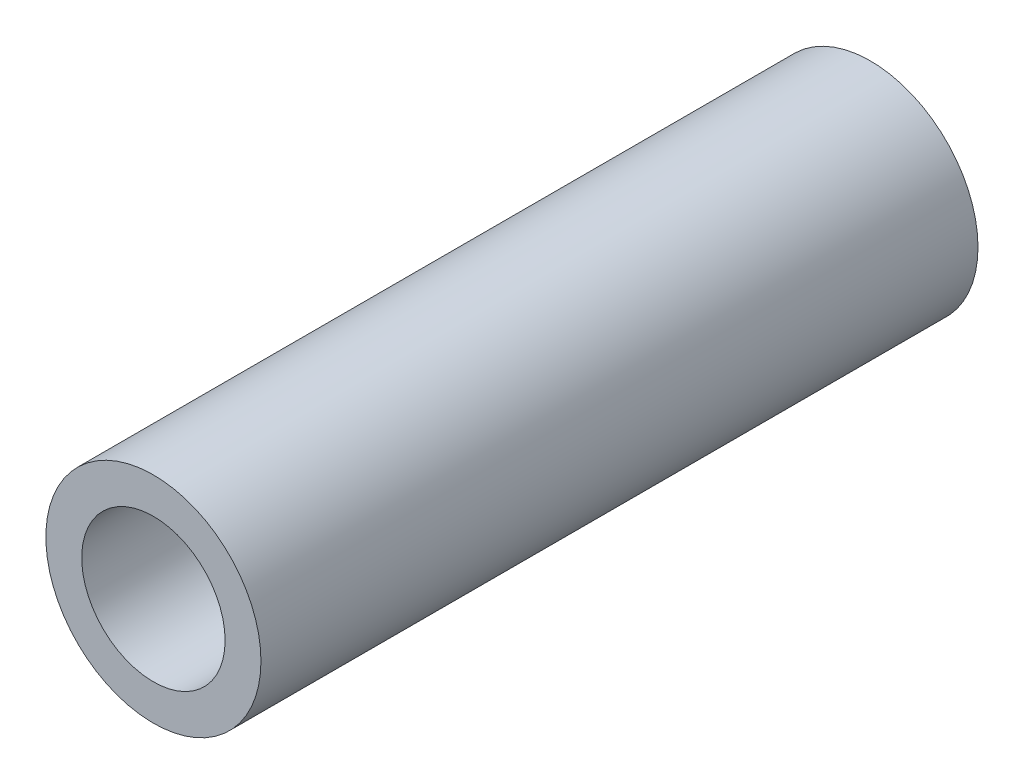
ISO-10303-21;
HEADER;
FILE_DESCRIPTION(('STEP AP214'),'2;1');
FILE_NAME('part.step','',(''),(''),'','','');
FILE_SCHEMA(('AUTOMOTIVE_DESIGN { 1 0 10303 214 1 1 1 1 }'));
ENDSEC;
DATA;
#1=APPLICATION_CONTEXT('core data for automotive mechanical design processes');
#2=APPLICATION_PROTOCOL_DEFINITION('international standard','automotive_design',2000,#1);
#3=PRODUCT_CONTEXT('',#1,'mechanical');
#4=PRODUCT('Part','Part','',(#3));
#5=PRODUCT_RELATED_PRODUCT_CATEGORY('part','',(#4));
#6=PRODUCT_DEFINITION_FORMATION('','',#4);
#7=PRODUCT_DEFINITION_CONTEXT('part definition',#1,'design');
#8=PRODUCT_DEFINITION('design','',#6,#7);
#9=PRODUCT_DEFINITION_SHAPE('','',#8);
#10=(LENGTH_UNIT() NAMED_UNIT(*) SI_UNIT(.MILLI.,.METRE.));
#11=(NAMED_UNIT(*) PLANE_ANGLE_UNIT() SI_UNIT($,.RADIAN.));
#12=(NAMED_UNIT(*) SI_UNIT($,.STERADIAN.) SOLID_ANGLE_UNIT());
#13=UNCERTAINTY_MEASURE_WITH_UNIT(LENGTH_MEASURE(1.E-05),#10,'distance_accuracy_value','');
#14=(GEOMETRIC_REPRESENTATION_CONTEXT(3) GLOBAL_UNCERTAINTY_ASSIGNED_CONTEXT((#13)) GLOBAL_UNIT_ASSIGNED_CONTEXT((#10,
#11,#12)) REPRESENTATION_CONTEXT('',''));
#15=CARTESIAN_POINT('',(0.,0.,0.));
#16=DIRECTION('',(0.,0.,1.));
#17=DIRECTION('',(1.,0.,0.));
#18=AXIS2_PLACEMENT_3D('',#15,#16,#17);
#19=CARTESIAN_POINT('',(0.,0.,20.));
#20=DIRECTION('',(0.,0.,0.999999999999998));
#21=DIRECTION('',(1.,0.,0.));
#22=AXIS2_PLACEMENT_3D('',#19,#20,#21);
#23=PLANE('',#22);
#24=CARTESIAN_POINT('',(0.,0.,20.));
#25=DIRECTION('',(0.,0.,0.999999999999998));
#26=DIRECTION('',(1.,0.,0.));
#27=AXIS2_PLACEMENT_3D('',#24,#25,#26);
#28=CIRCLE('',#27,3.);
#29=CARTESIAN_POINT('',(3.,0.,20.));
#30=VERTEX_POINT('',#29);
#31=EDGE_CURVE('E38',#30,#30,#28,.T.);
#32=ORIENTED_EDGE('',*,*,#31,.T.);
#33=EDGE_LOOP('',(#32));
#34=FACE_BOUND('',#33,.T.);
#35=CARTESIAN_POINT('',(0.,0.,20.));
#36=DIRECTION('',(0.,0.,0.999999999999998));
#37=DIRECTION('',(1.,0.,0.));
#38=AXIS2_PLACEMENT_3D('',#35,#36,#37);
#39=CIRCLE('',#38,2.);
#40=CARTESIAN_POINT('',(2.,0.,20.));
#41=VERTEX_POINT('',#40);
#42=EDGE_CURVE('E47',#41,#41,#39,.T.);
#43=ORIENTED_EDGE('',*,*,#42,.F.);
#44=EDGE_LOOP('',(#43));
#45=FACE_BOUND('',#44,.T.);
#46=ADVANCED_FACE('F31',(#34,#45),#23,.T.);
#47=CARTESIAN_POINT('',(0.,0.,0.));
#48=DIRECTION('',(0.,0.,0.999999999999998));
#49=DIRECTION('',(1.,0.,0.));
#50=AXIS2_PLACEMENT_3D('',#47,#48,#49);
#51=PLANE('',#50);
#52=CARTESIAN_POINT('',(0.,0.,0.));
#53=DIRECTION('',(0.,0.,0.999999999999998));
#54=DIRECTION('',(1.,0.,0.));
#55=AXIS2_PLACEMENT_3D('',#52,#53,#54);
#56=CIRCLE('',#55,3.);
#57=CARTESIAN_POINT('',(3.,0.,0.));
#58=VERTEX_POINT('',#57);
#59=EDGE_CURVE('E42',#58,#58,#56,.T.);
#60=ORIENTED_EDGE('',*,*,#59,.F.);
#61=EDGE_LOOP('',(#60));
#62=FACE_BOUND('',#61,.T.);
#63=ADVANCED_FACE('F55',(#62),#51,.F.);
#64=CARTESIAN_POINT('',(0.,0.,20.));
#65=DIRECTION('',(0.,0.,-0.999999999999998));
#66=DIRECTION('',(-1.,0.,0.));
#67=AXIS2_PLACEMENT_3D('',#64,#65,#66);
#68=CYLINDRICAL_SURFACE('',#67,3.);
#69=ORIENTED_EDGE('',*,*,#31,.F.);
#70=EDGE_LOOP('',(#69));
#71=FACE_BOUND('',#70,.T.);
#72=ORIENTED_EDGE('',*,*,#59,.T.);
#73=EDGE_LOOP('',(#72));
#74=FACE_BOUND('',#73,.T.);
#75=ADVANCED_FACE('F33',(#71,#74),#68,.T.);
#76=CARTESIAN_POINT('',(0.,0.,20.));
#77=DIRECTION('',(0.,0.,-0.999999999999998));
#78=DIRECTION('',(-1.,0.,0.));
#79=AXIS2_PLACEMENT_3D('',#76,#77,#78);
#80=CYLINDRICAL_SURFACE('',#79,2.);
#81=CARTESIAN_POINT('',(0.,0.,10.));
#82=DIRECTION('',(0.,0.,0.999999999999998));
#83=DIRECTION('',(1.,0.,0.));
#84=AXIS2_PLACEMENT_3D('',#81,#82,#83);
#85=CIRCLE('',#84,2.);
#86=CARTESIAN_POINT('',(2.,0.,10.));
#87=VERTEX_POINT('',#86);
#88=EDGE_CURVE('E10',#87,#87,#85,.T.);
#89=ORIENTED_EDGE('',*,*,#88,.F.);
#90=EDGE_LOOP('',(#89));
#91=FACE_BOUND('',#90,.T.);
#92=ORIENTED_EDGE('',*,*,#42,.T.);
#93=EDGE_LOOP('',(#92));
#94=FACE_BOUND('',#93,.T.);
#95=ADVANCED_FACE('F52',(#91,#94),#80,.F.);
#96=CARTESIAN_POINT('',(0.,0.,10.));
#97=DIRECTION('',(0.,0.,0.999999999999998));
#98=DIRECTION('',(1.,0.,0.));
#99=AXIS2_PLACEMENT_3D('',#96,#97,#98);
#100=PLANE('',#99);
#101=ORIENTED_EDGE('',*,*,#88,.T.);
#102=EDGE_LOOP('',(#101));
#103=FACE_BOUND('',#102,.T.);
#104=ADVANCED_FACE('F64',(#103),#100,.T.);
#105=CLOSED_SHELL('',(#46,#63,#75,#95,#104));
#106=MANIFOLD_SOLID_BREP('B2',#105);
#107=ADVANCED_BREP_SHAPE_REPRESENTATION('',(#18,#106),#14);
#108=SHAPE_DEFINITION_REPRESENTATION(#9,#107);
ENDSEC;
END-ISO-10303-21;
